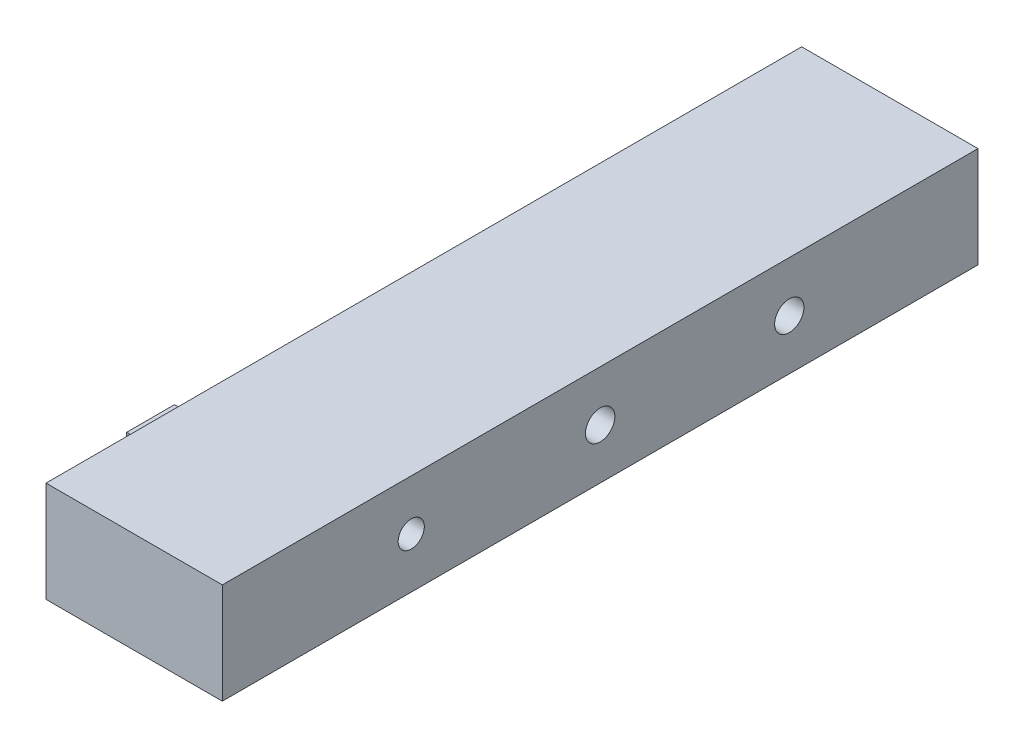
ISO-10303-21;
HEADER;
FILE_DESCRIPTION(('STEP AP214'),'2;1');
FILE_NAME('part.step','',(''),(''),'','','');
FILE_SCHEMA(('AUTOMOTIVE_DESIGN { 1 0 10303 214 1 1 1 1 }'));
ENDSEC;
DATA;
#1=APPLICATION_CONTEXT('core data for automotive mechanical design processes');
#2=APPLICATION_PROTOCOL_DEFINITION('international standard','automotive_design',2000,#1);
#3=PRODUCT_CONTEXT('',#1,'mechanical');
#4=PRODUCT('Part','Part','',(#3));
#5=PRODUCT_RELATED_PRODUCT_CATEGORY('part','',(#4));
#6=PRODUCT_DEFINITION_FORMATION('','',#4);
#7=PRODUCT_DEFINITION_CONTEXT('part definition',#1,'design');
#8=PRODUCT_DEFINITION('design','',#6,#7);
#9=PRODUCT_DEFINITION_SHAPE('','',#8);
#10=(LENGTH_UNIT() NAMED_UNIT(*) SI_UNIT(.MILLI.,.METRE.));
#11=(NAMED_UNIT(*) PLANE_ANGLE_UNIT() SI_UNIT($,.RADIAN.));
#12=(NAMED_UNIT(*) SI_UNIT($,.STERADIAN.) SOLID_ANGLE_UNIT());
#13=UNCERTAINTY_MEASURE_WITH_UNIT(LENGTH_MEASURE(1.E-05),#10,'distance_accuracy_value','');
#14=(GEOMETRIC_REPRESENTATION_CONTEXT(3) GLOBAL_UNCERTAINTY_ASSIGNED_CONTEXT((#13)) GLOBAL_UNIT_ASSIGNED_CONTEXT((#10,
#11,#12)) REPRESENTATION_CONTEXT('',''));
#15=CARTESIAN_POINT('',(0.,0.,0.));
#16=DIRECTION('',(0.,0.,1.));
#17=DIRECTION('',(1.,0.,0.));
#18=AXIS2_PLACEMENT_3D('',#15,#16,#17);
#19=CARTESIAN_POINT('',(7.,0.,0.));
#20=DIRECTION('',(0.,0.,-1.));
#21=DIRECTION('',(-1.,0.,0.));
#22=AXIS2_PLACEMENT_3D('',#19,#20,#21);
#23=PLANE('',#22);
#24=DIRECTION('',(0.,-1.,0.));
#25=VECTOR('',#24,1.);
#26=CARTESIAN_POINT('',(0.,0.,0.));
#27=LINE('',#26,#25);
#28=CARTESIAN_POINT('',(0.,4.,0.));
#29=VERTEX_POINT('',#28);
#30=CARTESIAN_POINT('',(0.,0.,0.));
#31=VERTEX_POINT('',#30);
#32=EDGE_CURVE('E177',#29,#31,#27,.T.);
#33=ORIENTED_EDGE('',*,*,#32,.T.);
#34=DIRECTION('',(-1.,0.,0.));
#35=VECTOR('',#34,1.);
#36=CARTESIAN_POINT('',(7.,0.,0.));
#37=LINE('',#36,#35);
#38=CARTESIAN_POINT('',(7.,0.,0.));
#39=VERTEX_POINT('',#38);
#40=EDGE_CURVE('E208',#39,#31,#37,.T.);
#41=ORIENTED_EDGE('',*,*,#40,.F.);
#42=DIRECTION('',(0.,-1.,0.));
#43=VECTOR('',#42,1.);
#44=CARTESIAN_POINT('',(7.,0.,0.));
#45=LINE('',#44,#43);
#46=CARTESIAN_POINT('',(7.,4.,0.));
#47=VERTEX_POINT('',#46);
#48=EDGE_CURVE('E182',#47,#39,#45,.T.);
#49=ORIENTED_EDGE('',*,*,#48,.F.);
#50=DIRECTION('',(-1.,0.,0.));
#51=VECTOR('',#50,1.);
#52=CARTESIAN_POINT('',(7.,4.,0.));
#53=LINE('',#52,#51);
#54=EDGE_CURVE('E192',#47,#29,#53,.T.);
#55=ORIENTED_EDGE('',*,*,#54,.T.);
#56=EDGE_LOOP('',(#33,#41,#49,#55));
#57=FACE_BOUND('',#56,.T.);
#58=ADVANCED_FACE('F33',(#57),#23,.F.);
#59=CARTESIAN_POINT('',(7.,0.,0.));
#60=DIRECTION('',(0.,1.,0.));
#61=DIRECTION('',(0.,0.,1.));
#62=AXIS2_PLACEMENT_3D('',#59,#60,#61);
#63=PLANE('',#62);
#64=DIRECTION('',(0.,0.,-1.));
#65=VECTOR('',#64,1.);
#66=CARTESIAN_POINT('',(0.,0.,0.));
#67=LINE('',#66,#65);
#68=CARTESIAN_POINT('',(0.,0.,-30.));
#69=VERTEX_POINT('',#68);
#70=EDGE_CURVE('E195',#31,#69,#67,.T.);
#71=ORIENTED_EDGE('',*,*,#70,.T.);
#72=DIRECTION('',(-1.,0.,0.));
#73=VECTOR('',#72,1.);
#74=CARTESIAN_POINT('',(7.,0.,-30.));
#75=LINE('',#74,#73);
#76=CARTESIAN_POINT('',(7.,0.,-30.));
#77=VERTEX_POINT('',#76);
#78=EDGE_CURVE('E205',#77,#69,#75,.T.);
#79=ORIENTED_EDGE('',*,*,#78,.F.);
#80=DIRECTION('',(0.,0.,-1.));
#81=VECTOR('',#80,1.);
#82=CARTESIAN_POINT('',(7.,0.,0.));
#83=LINE('',#82,#81);
#84=EDGE_CURVE('E185',#39,#77,#83,.T.);
#85=ORIENTED_EDGE('',*,*,#84,.F.);
#86=ORIENTED_EDGE('',*,*,#40,.T.);
#87=EDGE_LOOP('',(#71,#79,#85,#86));
#88=FACE_BOUND('',#87,.T.);
#89=ADVANCED_FACE('F246',(#88),#63,.F.);
#90=CARTESIAN_POINT('',(7.,0.,-30.));
#91=DIRECTION('',(0.,0.,1.));
#92=DIRECTION('',(1.,0.,0.));
#93=AXIS2_PLACEMENT_3D('',#90,#91,#92);
#94=PLANE('',#93);
#95=DIRECTION('',(0.,1.,0.));
#96=VECTOR('',#95,1.);
#97=CARTESIAN_POINT('',(0.,0.,-30.));
#98=LINE('',#97,#96);
#99=CARTESIAN_POINT('',(0.,4.,-30.));
#100=VERTEX_POINT('',#99);
#101=EDGE_CURVE('E197',#69,#100,#98,.T.);
#102=ORIENTED_EDGE('',*,*,#101,.T.);
#103=DIRECTION('',(-1.,0.,0.));
#104=VECTOR('',#103,1.);
#105=CARTESIAN_POINT('',(7.,4.,-30.));
#106=LINE('',#105,#104);
#107=CARTESIAN_POINT('',(7.,4.,-30.));
#108=VERTEX_POINT('',#107);
#109=EDGE_CURVE('E202',#108,#100,#106,.T.);
#110=ORIENTED_EDGE('',*,*,#109,.F.);
#111=DIRECTION('',(0.,1.,0.));
#112=VECTOR('',#111,1.);
#113=CARTESIAN_POINT('',(7.,0.,-30.));
#114=LINE('',#113,#112);
#115=EDGE_CURVE('E188',#77,#108,#114,.T.);
#116=ORIENTED_EDGE('',*,*,#115,.F.);
#117=ORIENTED_EDGE('',*,*,#78,.T.);
#118=EDGE_LOOP('',(#102,#110,#116,#117));
#119=FACE_BOUND('',#118,.T.);
#120=ADVANCED_FACE('F251',(#119),#94,.F.);
#121=CARTESIAN_POINT('',(7.,4.,0.));
#122=DIRECTION('',(0.,-1.,0.));
#123=DIRECTION('',(0.,0.,-1.));
#124=AXIS2_PLACEMENT_3D('',#121,#122,#123);
#125=PLANE('',#124);
#126=DIRECTION('',(0.,0.,1.));
#127=VECTOR('',#126,1.);
#128=CARTESIAN_POINT('',(0.,4.,0.));
#129=LINE('',#128,#127);
#130=EDGE_CURVE('E186',#100,#29,#129,.T.);
#131=ORIENTED_EDGE('',*,*,#130,.T.);
#132=ORIENTED_EDGE('',*,*,#54,.F.);
#133=DIRECTION('',(0.,0.,1.));
#134=VECTOR('',#133,1.);
#135=CARTESIAN_POINT('',(7.,4.,0.));
#136=LINE('',#135,#134);
#137=EDGE_CURVE('E190',#108,#47,#136,.T.);
#138=ORIENTED_EDGE('',*,*,#137,.F.);
#139=ORIENTED_EDGE('',*,*,#109,.T.);
#140=EDGE_LOOP('',(#131,#132,#138,#139));
#141=FACE_BOUND('',#140,.T.);
#142=ADVANCED_FACE('F267',(#141),#125,.F.);
#143=CARTESIAN_POINT('',(7.,0.,0.));
#144=DIRECTION('',(-1.,0.,0.));
#145=DIRECTION('',(0.,0.,1.));
#146=AXIS2_PLACEMENT_3D('',#143,#144,#145);
#147=PLANE('',#146);
#148=CARTESIAN_POINT('',(7.,2.,-7.5));
#149=DIRECTION('',(-1.,0.,0.));
#150=DIRECTION('',(0.,0.,1.));
#151=AXIS2_PLACEMENT_3D('',#148,#149,#150);
#152=CIRCLE('',#151,0.519223144868741);
#153=CARTESIAN_POINT('',(7.,2.,-6.98077685513126));
#154=VERTEX_POINT('',#153);
#155=EDGE_CURVE('E36',#154,#154,#152,.T.);
#156=ORIENTED_EDGE('',*,*,#155,.T.);
#157=EDGE_LOOP('',(#156));
#158=FACE_BOUND('',#157,.T.);
#159=CARTESIAN_POINT('',(7.,2.,-15.));
#160=DIRECTION('',(-1.,0.,0.));
#161=DIRECTION('',(0.,0.,1.));
#162=AXIS2_PLACEMENT_3D('',#159,#160,#161);
#163=CIRCLE('',#162,0.583770960636984);
#164=CARTESIAN_POINT('',(7.,2.,-14.416229039363));
#165=VERTEX_POINT('',#164);
#166=EDGE_CURVE('E219',#165,#165,#163,.T.);
#167=ORIENTED_EDGE('',*,*,#166,.T.);
#168=EDGE_LOOP('',(#167));
#169=FACE_BOUND('',#168,.T.);
#170=CARTESIAN_POINT('',(7.,2.,-22.5084861687063));
#171=DIRECTION('',(-1.,0.,0.));
#172=DIRECTION('',(0.,0.,1.));
#173=AXIS2_PLACEMENT_3D('',#170,#171,#172);
#174=CIRCLE('',#173,0.581603631336125);
#175=CARTESIAN_POINT('',(7.,2.,-21.9268825373702));
#176=VERTEX_POINT('',#175);
#177=EDGE_CURVE('E217',#176,#176,#174,.T.);
#178=ORIENTED_EDGE('',*,*,#177,.T.);
#179=EDGE_LOOP('',(#178));
#180=FACE_BOUND('',#179,.T.);
#181=ORIENTED_EDGE('',*,*,#48,.T.);
#182=ORIENTED_EDGE('',*,*,#84,.T.);
#183=ORIENTED_EDGE('',*,*,#115,.T.);
#184=ORIENTED_EDGE('',*,*,#137,.T.);
#185=EDGE_LOOP('',(#181,#182,#183,#184));
#186=FACE_BOUND('',#185,.T.);
#187=ADVANCED_FACE('F227',(#158,#169,#180,#186),#147,.F.);
#188=CARTESIAN_POINT('',(0.,0.,0.));
#189=DIRECTION('',(-1.,0.,0.));
#190=DIRECTION('',(0.,0.,1.));
#191=AXIS2_PLACEMENT_3D('',#188,#189,#190);
#192=PLANE('',#191);
#193=DIRECTION('',(0.,0.,1.));
#194=VECTOR('',#193,1.);
#195=CARTESIAN_POINT('',(0.,1.1343647360158,0.));
#196=LINE('',#195,#194);
#197=CARTESIAN_POINT('',(0.,1.1343647360158,-25.7069155227249));
#198=VERTEX_POINT('',#197);
#199=CARTESIAN_POINT('',(0.,1.1343647360158,-23.8069155227249));
#200=VERTEX_POINT('',#199);
#201=EDGE_CURVE('E11',#198,#200,#196,.T.);
#202=ORIENTED_EDGE('',*,*,#201,.F.);
#203=DIRECTION('',(0.,-1.,0.));
#204=VECTOR('',#203,1.);
#205=CARTESIAN_POINT('',(0.,0.,-25.7069155227249));
#206=LINE('',#205,#204);
#207=CARTESIAN_POINT('',(0.,2.90376242993588,-25.7069155227249));
#208=VERTEX_POINT('',#207);
#209=EDGE_CURVE('E41',#208,#198,#206,.T.);
#210=ORIENTED_EDGE('',*,*,#209,.F.);
#211=DIRECTION('',(0.,0.,1.));
#212=VECTOR('',#211,1.);
#213=CARTESIAN_POINT('',(0.,2.90376242993588,0.));
#214=LINE('',#213,#212);
#215=CARTESIAN_POINT('',(0.,2.90376242993588,-23.8069155227249));
#216=VERTEX_POINT('',#215);
#217=EDGE_CURVE('E213',#208,#216,#214,.T.);
#218=ORIENTED_EDGE('',*,*,#217,.T.);
#219=DIRECTION('',(0.,-1.,0.));
#220=VECTOR('',#219,1.);
#221=CARTESIAN_POINT('',(0.,0.,-23.8069155227249));
#222=LINE('',#221,#220);
#223=EDGE_CURVE('E211',#216,#200,#222,.T.);
#224=ORIENTED_EDGE('',*,*,#223,.T.);
#225=EDGE_LOOP('',(#202,#210,#218,#224));
#226=FACE_BOUND('',#225,.T.);
#227=DIRECTION('',(0.,0.,-1.));
#228=VECTOR('',#227,1.);
#229=CARTESIAN_POINT('',(0.,1.2461745940159,-4.2006128605298));
#230=LINE('',#229,#228);
#231=CARTESIAN_POINT('',(0.,1.2461745940159,-4.2006128605298));
#232=VERTEX_POINT('',#231);
#233=CARTESIAN_POINT('',(0.,1.2461745940159,-6.1006128605298));
#234=VERTEX_POINT('',#233);
#235=EDGE_CURVE('E151',#232,#234,#230,.T.);
#236=ORIENTED_EDGE('',*,*,#235,.T.);
#237=DIRECTION('',(0.,-1.,0.));
#238=VECTOR('',#237,1.);
#239=CARTESIAN_POINT('',(0.,3.1461745940159,-6.1006128605298));
#240=LINE('',#239,#238);
#241=CARTESIAN_POINT('',(0.,3.1461745940159,-6.1006128605298));
#242=VERTEX_POINT('',#241);
#243=EDGE_CURVE('E169',#242,#234,#240,.T.);
#244=ORIENTED_EDGE('',*,*,#243,.F.);
#245=DIRECTION('',(0.,0.,-1.));
#246=VECTOR('',#245,1.);
#247=CARTESIAN_POINT('',(0.,3.1461745940159,-4.2006128605298));
#248=LINE('',#247,#246);
#249=CARTESIAN_POINT('',(0.,3.1461745940159,-4.2006128605298));
#250=VERTEX_POINT('',#249);
#251=EDGE_CURVE('E171',#250,#242,#248,.T.);
#252=ORIENTED_EDGE('',*,*,#251,.F.);
#253=DIRECTION('',(0.,-1.,0.));
#254=VECTOR('',#253,1.);
#255=CARTESIAN_POINT('',(0.,3.1461745940159,-4.2006128605298));
#256=LINE('',#255,#254);
#257=EDGE_CURVE('E159',#250,#232,#256,.T.);
#258=ORIENTED_EDGE('',*,*,#257,.T.);
#259=EDGE_LOOP('',(#236,#244,#252,#258));
#260=FACE_BOUND('',#259,.T.);
#261=ORIENTED_EDGE('',*,*,#32,.F.);
#262=ORIENTED_EDGE('',*,*,#130,.F.);
#263=ORIENTED_EDGE('',*,*,#101,.F.);
#264=ORIENTED_EDGE('',*,*,#70,.F.);
#265=EDGE_LOOP('',(#261,#262,#263,#264));
#266=FACE_BOUND('',#265,.T.);
#267=ADVANCED_FACE('F259',(#226,#260,#266),#192,.T.);
#268=CARTESIAN_POINT('',(-0.999999999999997,1.2461745940159,-4.2006128605298));
#269=DIRECTION('',(0.,-1.,0.));
#270=DIRECTION('',(0.,0.,-1.));
#271=AXIS2_PLACEMENT_3D('',#268,#269,#270);
#272=PLANE('',#271);
#273=ORIENTED_EDGE('',*,*,#235,.F.);
#274=DIRECTION('',(1.,0.,0.));
#275=VECTOR('',#274,1.);
#276=CARTESIAN_POINT('',(-0.999999999999997,1.2461745940159,-4.2006128605298));
#277=LINE('',#276,#275);
#278=CARTESIAN_POINT('',(-0.999999999999997,1.2461745940159,-4.2006128605298));
#279=VERTEX_POINT('',#278);
#280=EDGE_CURVE('E175',#279,#232,#277,.T.);
#281=ORIENTED_EDGE('',*,*,#280,.F.);
#282=DIRECTION('',(0.,0.,-1.));
#283=VECTOR('',#282,1.);
#284=CARTESIAN_POINT('',(-0.999999999999997,1.2461745940159,-4.2006128605298));
#285=LINE('',#284,#283);
#286=CARTESIAN_POINT('',(-0.999999999999997,1.2461745940159,-6.1006128605298));
#287=VERTEX_POINT('',#286);
#288=EDGE_CURVE('E155',#279,#287,#285,.T.);
#289=ORIENTED_EDGE('',*,*,#288,.T.);
#290=DIRECTION('',(1.,0.,0.));
#291=VECTOR('',#290,1.);
#292=CARTESIAN_POINT('',(-0.999999999999997,1.2461745940159,-6.1006128605298));
#293=LINE('',#292,#291);
#294=EDGE_CURVE('E166',#287,#234,#293,.T.);
#295=ORIENTED_EDGE('',*,*,#294,.T.);
#296=EDGE_LOOP('',(#273,#281,#289,#295));
#297=FACE_BOUND('',#296,.T.);
#298=ADVANCED_FACE('F278',(#297),#272,.T.);
#299=CARTESIAN_POINT('',(-0.999999999999997,3.1461745940159,-4.2006128605298));
#300=DIRECTION('',(0.,0.,1.));
#301=DIRECTION('',(1.,0.,0.));
#302=AXIS2_PLACEMENT_3D('',#299,#300,#301);
#303=PLANE('',#302);
#304=ORIENTED_EDGE('',*,*,#257,.F.);
#305=DIRECTION('',(1.,0.,0.));
#306=VECTOR('',#305,1.);
#307=CARTESIAN_POINT('',(-0.999999999999997,3.1461745940159,-4.2006128605298));
#308=LINE('',#307,#306);
#309=CARTESIAN_POINT('',(-0.999999999999997,3.1461745940159,-4.2006128605298));
#310=VERTEX_POINT('',#309);
#311=EDGE_CURVE('E178',#310,#250,#308,.T.);
#312=ORIENTED_EDGE('',*,*,#311,.F.);
#313=DIRECTION('',(0.,-1.,0.));
#314=VECTOR('',#313,1.);
#315=CARTESIAN_POINT('',(-0.999999999999997,3.1461745940159,-4.2006128605298));
#316=LINE('',#315,#314);
#317=EDGE_CURVE('E163',#310,#279,#316,.T.);
#318=ORIENTED_EDGE('',*,*,#317,.T.);
#319=ORIENTED_EDGE('',*,*,#280,.T.);
#320=EDGE_LOOP('',(#304,#312,#318,#319));
#321=FACE_BOUND('',#320,.T.);
#322=ADVANCED_FACE('F284',(#321),#303,.T.);
#323=CARTESIAN_POINT('',(-0.999999999999997,3.1461745940159,-4.2006128605298));
#324=DIRECTION('',(0.,-1.,0.));
#325=DIRECTION('',(0.,0.,-1.));
#326=AXIS2_PLACEMENT_3D('',#323,#324,#325);
#327=PLANE('',#326);
#328=ORIENTED_EDGE('',*,*,#251,.T.);
#329=DIRECTION('',(1.,0.,0.));
#330=VECTOR('',#329,1.);
#331=CARTESIAN_POINT('',(-0.999999999999997,3.1461745940159,-6.1006128605298));
#332=LINE('',#331,#330);
#333=CARTESIAN_POINT('',(-0.999999999999997,3.1461745940159,-6.1006128605298));
#334=VERTEX_POINT('',#333);
#335=EDGE_CURVE('E56',#334,#242,#332,.T.);
#336=ORIENTED_EDGE('',*,*,#335,.F.);
#337=DIRECTION('',(0.,0.,-1.));
#338=VECTOR('',#337,1.);
#339=CARTESIAN_POINT('',(-0.999999999999997,3.1461745940159,-4.2006128605298));
#340=LINE('',#339,#338);
#341=EDGE_CURVE('E161',#310,#334,#340,.T.);
#342=ORIENTED_EDGE('',*,*,#341,.F.);
#343=ORIENTED_EDGE('',*,*,#311,.T.);
#344=EDGE_LOOP('',(#328,#336,#342,#343));
#345=FACE_BOUND('',#344,.T.);
#346=ADVANCED_FACE('F290',(#345),#327,.F.);
#347=CARTESIAN_POINT('',(-0.999999999999997,3.1461745940159,-6.1006128605298));
#348=DIRECTION('',(0.,0.,1.));
#349=DIRECTION('',(1.,0.,0.));
#350=AXIS2_PLACEMENT_3D('',#347,#348,#349);
#351=PLANE('',#350);
#352=ORIENTED_EDGE('',*,*,#243,.T.);
#353=ORIENTED_EDGE('',*,*,#294,.F.);
#354=DIRECTION('',(0.,-1.,0.));
#355=VECTOR('',#354,1.);
#356=CARTESIAN_POINT('',(-0.999999999999997,3.1461745940159,-6.1006128605298));
#357=LINE('',#356,#355);
#358=EDGE_CURVE('E158',#334,#287,#357,.T.);
#359=ORIENTED_EDGE('',*,*,#358,.F.);
#360=ORIENTED_EDGE('',*,*,#335,.T.);
#361=EDGE_LOOP('',(#352,#353,#359,#360));
#362=FACE_BOUND('',#361,.T.);
#363=ADVANCED_FACE('F286',(#362),#351,.F.);
#364=CARTESIAN_POINT('',(-0.999999999999997,0.,0.));
#365=DIRECTION('',(-1.,0.,0.));
#366=DIRECTION('',(0.,0.,1.));
#367=AXIS2_PLACEMENT_3D('',#364,#365,#366);
#368=PLANE('',#367);
#369=ORIENTED_EDGE('',*,*,#288,.F.);
#370=ORIENTED_EDGE('',*,*,#317,.F.);
#371=ORIENTED_EDGE('',*,*,#341,.T.);
#372=ORIENTED_EDGE('',*,*,#358,.T.);
#373=EDGE_LOOP('',(#369,#370,#371,#372));
#374=FACE_BOUND('',#373,.T.);
#375=ADVANCED_FACE('F289',(#374),#368,.T.);
#376=CARTESIAN_POINT('',(1.,1.1343647360158,-25.7069155227249));
#377=DIRECTION('',(0.,-1.,0.));
#378=DIRECTION('',(0.,0.,-1.));
#379=AXIS2_PLACEMENT_3D('',#376,#377,#378);
#380=PLANE('',#379);
#381=DIRECTION('',(-1.,0.,0.));
#382=VECTOR('',#381,1.);
#383=CARTESIAN_POINT('',(1.,1.1343647360158,-25.7069155227249));
#384=LINE('',#383,#382);
#385=CARTESIAN_POINT('',(-0.999999999999997,1.1343647360158,-25.7069155227249));
#386=VERTEX_POINT('',#385);
#387=EDGE_CURVE('E149',#198,#386,#384,.T.);
#388=ORIENTED_EDGE('',*,*,#387,.F.);
#389=ORIENTED_EDGE('',*,*,#201,.T.);
#390=DIRECTION('',(-1.,0.,0.));
#391=VECTOR('',#390,1.);
#392=CARTESIAN_POINT('',(1.,1.1343647360158,-23.8069155227249));
#393=LINE('',#392,#391);
#394=CARTESIAN_POINT('',(-0.999999999999997,1.1343647360158,-23.8069155227249));
#395=VERTEX_POINT('',#394);
#396=EDGE_CURVE('E49',#200,#395,#393,.T.);
#397=ORIENTED_EDGE('',*,*,#396,.T.);
#398=DIRECTION('',(0.,0.,1.));
#399=VECTOR('',#398,1.);
#400=CARTESIAN_POINT('',(-0.999999999999997,1.1343647360158,-25.7069155227249));
#401=LINE('',#400,#399);
#402=EDGE_CURVE('E126',#386,#395,#401,.T.);
#403=ORIENTED_EDGE('',*,*,#402,.F.);
#404=EDGE_LOOP('',(#388,#389,#397,#403));
#405=FACE_BOUND('',#404,.T.);
#406=ADVANCED_FACE('F125',(#405),#380,.T.);
#407=CARTESIAN_POINT('',(1.,2.90376242993588,-25.7069155227249));
#408=DIRECTION('',(0.,0.,-1.));
#409=DIRECTION('',(-1.,0.,0.));
#410=AXIS2_PLACEMENT_3D('',#407,#408,#409);
#411=PLANE('',#410);
#412=DIRECTION('',(-1.,0.,0.));
#413=VECTOR('',#412,1.);
#414=CARTESIAN_POINT('',(1.,2.90376242993588,-25.7069155227249));
#415=LINE('',#414,#413);
#416=CARTESIAN_POINT('',(-0.999999999999997,2.90376242993588,-25.7069155227249));
#417=VERTEX_POINT('',#416);
#418=EDGE_CURVE('E152',#208,#417,#415,.T.);
#419=ORIENTED_EDGE('',*,*,#418,.F.);
#420=ORIENTED_EDGE('',*,*,#209,.T.);
#421=ORIENTED_EDGE('',*,*,#387,.T.);
#422=DIRECTION('',(0.,-1.,0.));
#423=VECTOR('',#422,1.);
#424=CARTESIAN_POINT('',(-0.999999999999997,2.90376242993588,-25.7069155227249));
#425=LINE('',#424,#423);
#426=EDGE_CURVE('E130',#417,#386,#425,.T.);
#427=ORIENTED_EDGE('',*,*,#426,.F.);
#428=EDGE_LOOP('',(#419,#420,#421,#427));
#429=FACE_BOUND('',#428,.T.);
#430=ADVANCED_FACE('F302',(#429),#411,.T.);
#431=CARTESIAN_POINT('',(1.,2.90376242993588,-25.7069155227249));
#432=DIRECTION('',(0.,-1.,0.));
#433=DIRECTION('',(0.,0.,-1.));
#434=AXIS2_PLACEMENT_3D('',#431,#432,#433);
#435=PLANE('',#434);
#436=ORIENTED_EDGE('',*,*,#217,.F.);
#437=ORIENTED_EDGE('',*,*,#418,.T.);
#438=DIRECTION('',(0.,0.,1.));
#439=VECTOR('',#438,1.);
#440=CARTESIAN_POINT('',(-0.999999999999997,2.90376242993588,-25.7069155227249));
#441=LINE('',#440,#439);
#442=CARTESIAN_POINT('',(-0.999999999999997,2.90376242993588,-23.8069155227249));
#443=VERTEX_POINT('',#442);
#444=EDGE_CURVE('E143',#417,#443,#441,.T.);
#445=ORIENTED_EDGE('',*,*,#444,.T.);
#446=DIRECTION('',(-1.,0.,0.));
#447=VECTOR('',#446,1.);
#448=CARTESIAN_POINT('',(1.,2.90376242993588,-23.8069155227249));
#449=LINE('',#448,#447);
#450=EDGE_CURVE('E129',#216,#443,#449,.T.);
#451=ORIENTED_EDGE('',*,*,#450,.F.);
#452=EDGE_LOOP('',(#436,#437,#445,#451));
#453=FACE_BOUND('',#452,.T.);
#454=ADVANCED_FACE('F305',(#453),#435,.F.);
#455=CARTESIAN_POINT('',(1.,2.90376242993588,-23.8069155227249));
#456=DIRECTION('',(0.,0.,-1.));
#457=DIRECTION('',(-1.,0.,0.));
#458=AXIS2_PLACEMENT_3D('',#455,#456,#457);
#459=PLANE('',#458);
#460=ORIENTED_EDGE('',*,*,#223,.F.);
#461=ORIENTED_EDGE('',*,*,#450,.T.);
#462=DIRECTION('',(0.,-1.,0.));
#463=VECTOR('',#462,1.);
#464=CARTESIAN_POINT('',(-0.999999999999997,2.90376242993588,-23.8069155227249));
#465=LINE('',#464,#463);
#466=EDGE_CURVE('E137',#443,#395,#465,.T.);
#467=ORIENTED_EDGE('',*,*,#466,.T.);
#468=ORIENTED_EDGE('',*,*,#396,.F.);
#469=EDGE_LOOP('',(#460,#461,#467,#468));
#470=FACE_BOUND('',#469,.T.);
#471=ADVANCED_FACE('F141',(#470),#459,.F.);
#472=CARTESIAN_POINT('',(-0.999999999999997,0.,0.));
#473=DIRECTION('',(1.,0.,0.));
#474=DIRECTION('',(0.,0.,-1.));
#475=AXIS2_PLACEMENT_3D('',#472,#473,#474);
#476=PLANE('',#475);
#477=ORIENTED_EDGE('',*,*,#402,.T.);
#478=ORIENTED_EDGE('',*,*,#466,.F.);
#479=ORIENTED_EDGE('',*,*,#444,.F.);
#480=ORIENTED_EDGE('',*,*,#426,.T.);
#481=EDGE_LOOP('',(#477,#478,#479,#480));
#482=FACE_BOUND('',#481,.T.);
#483=ADVANCED_FACE('F135',(#482),#476,.F.);
#484=CARTESIAN_POINT('',(4.,2.,-22.5084861687063));
#485=DIRECTION('',(1.,0.,0.));
#486=DIRECTION('',(0.,0.,-1.));
#487=AXIS2_PLACEMENT_3D('',#484,#485,#486);
#488=CYLINDRICAL_SURFACE('',#487,0.581603631336125);
#489=CARTESIAN_POINT('',(4.,2.,-22.5084861687063));
#490=DIRECTION('',(1.,0.,0.));
#491=DIRECTION('',(0.,0.,-1.));
#492=AXIS2_PLACEMENT_3D('',#489,#490,#491);
#493=CIRCLE('',#492,0.581603631336125);
#494=CARTESIAN_POINT('',(4.,2.,-23.0900898000425));
#495=VERTEX_POINT('',#494);
#496=EDGE_CURVE('E330',#495,#495,#493,.T.);
#497=ORIENTED_EDGE('',*,*,#496,.F.);
#498=EDGE_LOOP('',(#497));
#499=FACE_BOUND('',#498,.T.);
#500=ORIENTED_EDGE('',*,*,#177,.F.);
#501=EDGE_LOOP('',(#500));
#502=FACE_BOUND('',#501,.T.);
#503=ADVANCED_FACE('F314',(#499,#502),#488,.F.);
#504=CARTESIAN_POINT('',(4.,2.,-22.5084861687063));
#505=DIRECTION('',(1.,0.,0.));
#506=DIRECTION('',(0.,0.,-1.));
#507=AXIS2_PLACEMENT_3D('',#504,#505,#506);
#508=PLANE('',#507);
#509=ORIENTED_EDGE('',*,*,#496,.T.);
#510=EDGE_LOOP('',(#509));
#511=FACE_BOUND('',#510,.T.);
#512=ADVANCED_FACE('F317',(#511),#508,.T.);
#513=CARTESIAN_POINT('',(4.,2.,-15.));
#514=DIRECTION('',(1.,0.,0.));
#515=DIRECTION('',(0.,0.,-1.));
#516=AXIS2_PLACEMENT_3D('',#513,#514,#515);
#517=CYLINDRICAL_SURFACE('',#516,0.583770960636984);
#518=CARTESIAN_POINT('',(4.,2.,-15.));
#519=DIRECTION('',(1.,0.,0.));
#520=DIRECTION('',(0.,0.,-1.));
#521=AXIS2_PLACEMENT_3D('',#518,#519,#520);
#522=CIRCLE('',#521,0.583770960636984);
#523=CARTESIAN_POINT('',(4.,2.,-15.583770960637));
#524=VERTEX_POINT('',#523);
#525=EDGE_CURVE('E329',#524,#524,#522,.T.);
#526=ORIENTED_EDGE('',*,*,#525,.F.);
#527=EDGE_LOOP('',(#526));
#528=FACE_BOUND('',#527,.T.);
#529=ORIENTED_EDGE('',*,*,#166,.F.);
#530=EDGE_LOOP('',(#529));
#531=FACE_BOUND('',#530,.T.);
#532=ADVANCED_FACE('F241',(#528,#531),#517,.F.);
#533=CARTESIAN_POINT('',(4.,2.,-15.));
#534=DIRECTION('',(1.,0.,0.));
#535=DIRECTION('',(0.,0.,-1.));
#536=AXIS2_PLACEMENT_3D('',#533,#534,#535);
#537=PLANE('',#536);
#538=ORIENTED_EDGE('',*,*,#525,.T.);
#539=EDGE_LOOP('',(#538));
#540=FACE_BOUND('',#539,.T.);
#541=ADVANCED_FACE('F232',(#540),#537,.T.);
#542=CARTESIAN_POINT('',(4.,2.,-7.5));
#543=DIRECTION('',(1.,0.,0.));
#544=DIRECTION('',(0.,0.,-1.));
#545=AXIS2_PLACEMENT_3D('',#542,#543,#544);
#546=CYLINDRICAL_SURFACE('',#545,0.519223144868741);
#547=CARTESIAN_POINT('',(4.,2.,-7.5));
#548=DIRECTION('',(1.,0.,0.));
#549=DIRECTION('',(0.,0.,-1.));
#550=AXIS2_PLACEMENT_3D('',#547,#548,#549);
#551=CIRCLE('',#550,0.519223144868741);
#552=CARTESIAN_POINT('',(4.,2.,-8.01922314486874));
#553=VERTEX_POINT('',#552);
#554=EDGE_CURVE('E220',#553,#553,#551,.T.);
#555=ORIENTED_EDGE('',*,*,#554,.F.);
#556=EDGE_LOOP('',(#555));
#557=FACE_BOUND('',#556,.T.);
#558=ORIENTED_EDGE('',*,*,#155,.F.);
#559=EDGE_LOOP('',(#558));
#560=FACE_BOUND('',#559,.T.);
#561=ADVANCED_FACE('F229',(#557,#560),#546,.F.);
#562=CARTESIAN_POINT('',(4.,2.,-7.5));
#563=DIRECTION('',(1.,0.,0.));
#564=DIRECTION('',(0.,0.,-1.));
#565=AXIS2_PLACEMENT_3D('',#562,#563,#564);
#566=PLANE('',#565);
#567=ORIENTED_EDGE('',*,*,#554,.T.);
#568=EDGE_LOOP('',(#567));
#569=FACE_BOUND('',#568,.T.);
#570=ADVANCED_FACE('F231',(#569),#566,.T.);
#571=CLOSED_SHELL('',(#58,#89,#120,#142,#187,#267,#298,#322,#346,#363,#375,#406,#430,#454,#471,
#483,#503,#512,#532,#541,#561,#570));
#572=MANIFOLD_SOLID_BREP('B2',#571);
#573=ADVANCED_BREP_SHAPE_REPRESENTATION('',(#18,#572),#14);
#574=SHAPE_DEFINITION_REPRESENTATION(#9,#573);
ENDSEC;
END-ISO-10303-21;
